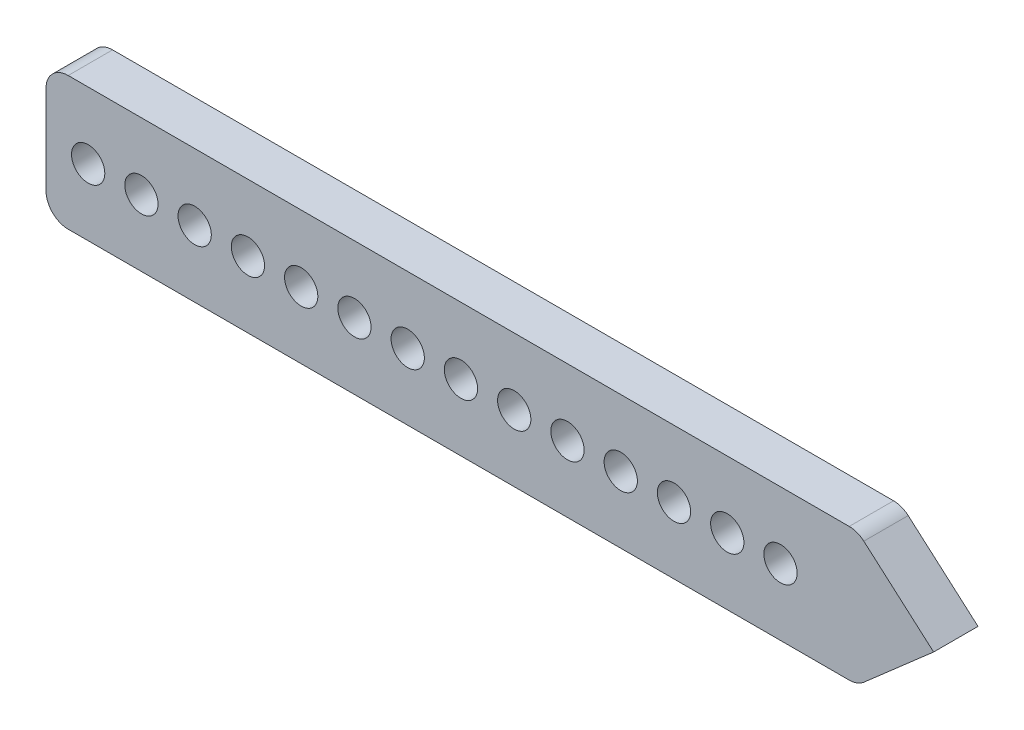
ISO-10303-21;
HEADER;
FILE_DESCRIPTION(('STEP AP214'),'2;1');
FILE_NAME('part.step','',(''),(''),'','','');
FILE_SCHEMA(('AUTOMOTIVE_DESIGN { 1 0 10303 214 1 1 1 1 }'));
ENDSEC;
DATA;
#1=APPLICATION_CONTEXT('core data for automotive mechanical design processes');
#2=APPLICATION_PROTOCOL_DEFINITION('international standard','automotive_design',2000,#1);
#3=PRODUCT_CONTEXT('',#1,'mechanical');
#4=PRODUCT('Part','Part','',(#3));
#5=PRODUCT_RELATED_PRODUCT_CATEGORY('part','',(#4));
#6=PRODUCT_DEFINITION_FORMATION('','',#4);
#7=PRODUCT_DEFINITION_CONTEXT('part definition',#1,'design');
#8=PRODUCT_DEFINITION('design','',#6,#7);
#9=PRODUCT_DEFINITION_SHAPE('','',#8);
#10=(LENGTH_UNIT() NAMED_UNIT(*) SI_UNIT(.MILLI.,.METRE.));
#11=(NAMED_UNIT(*) PLANE_ANGLE_UNIT() SI_UNIT($,.RADIAN.));
#12=(NAMED_UNIT(*) SI_UNIT($,.STERADIAN.) SOLID_ANGLE_UNIT());
#13=UNCERTAINTY_MEASURE_WITH_UNIT(LENGTH_MEASURE(1.E-05),#10,'distance_accuracy_value','');
#14=(GEOMETRIC_REPRESENTATION_CONTEXT(3) GLOBAL_UNCERTAINTY_ASSIGNED_CONTEXT((#13)) GLOBAL_UNIT_ASSIGNED_CONTEXT((#10,
#11,#12)) REPRESENTATION_CONTEXT('',''));
#15=CARTESIAN_POINT('',(0.,0.,0.));
#16=DIRECTION('',(0.,0.,1.));
#17=DIRECTION('',(1.,0.,0.));
#18=AXIS2_PLACEMENT_3D('',#15,#16,#17);
#19=CARTESIAN_POINT('',(17.9099791588191,2.,2.));
#20=DIRECTION('',(0.,0.,-1.));
#21=DIRECTION('',(-1.,0.,0.));
#22=AXIS2_PLACEMENT_3D('',#19,#20,#21);
#23=PLANE('',#22);
#24=DIRECTION('',(-0.752576682254107,0.658504622100256,0.));
#25=VECTOR('',#24,1.);
#26=CARTESIAN_POINT('',(21.7142857142857,-1.14477163139563E-07,2.));
#27=LINE('',#26,#25);
#28=CARTESIAN_POINT('',(21.7142857142857,-1.14477163139563E-07,2.));
#29=VERTEX_POINT('',#28);
#30=CARTESIAN_POINT('',(18.5684837809194,2.75257668225411,2.));
#31=VERTEX_POINT('',#30);
#32=EDGE_CURVE('E159',#29,#31,#27,.T.);
#33=ORIENTED_EDGE('',*,*,#32,.T.);
#34=CARTESIAN_POINT('',(17.9099791588191,2.,2.));
#35=DIRECTION('',(0.,0.,1.));
#36=DIRECTION('',(-1.,0.,0.));
#37=AXIS2_PLACEMENT_3D('',#34,#35,#36);
#38=CIRCLE('',#37,1.);
#39=CARTESIAN_POINT('',(17.9099791588191,3.,2.));
#40=VERTEX_POINT('',#39);
#41=EDGE_CURVE('E102',#31,#40,#38,.T.);
#42=ORIENTED_EDGE('',*,*,#41,.T.);
#43=DIRECTION('',(-1.,0.,0.));
#44=VECTOR('',#43,1.);
#45=CARTESIAN_POINT('',(-17.2857142857143,3.,2.));
#46=LINE('',#45,#44);
#47=CARTESIAN_POINT('',(-17.2857142857143,3.,2.));
#48=VERTEX_POINT('',#47);
#49=EDGE_CURVE('E177',#40,#48,#46,.T.);
#50=ORIENTED_EDGE('',*,*,#49,.T.);
#51=CARTESIAN_POINT('',(-17.2857142857143,2.,2.));
#52=DIRECTION('',(0.,0.,1.));
#53=DIRECTION('',(1.,0.,0.));
#54=AXIS2_PLACEMENT_3D('',#51,#52,#53);
#55=CIRCLE('',#54,1.);
#56=CARTESIAN_POINT('',(-18.2857142857143,2.,2.));
#57=VERTEX_POINT('',#56);
#58=EDGE_CURVE('E194',#48,#57,#55,.T.);
#59=ORIENTED_EDGE('',*,*,#58,.T.);
#60=DIRECTION('',(0.,-1.,0.));
#61=VECTOR('',#60,1.);
#62=CARTESIAN_POINT('',(-18.2857142857143,2.,2.));
#63=LINE('',#62,#61);
#64=CARTESIAN_POINT('',(-18.2857142857143,-2.,2.));
#65=VERTEX_POINT('',#64);
#66=EDGE_CURVE('E193',#57,#65,#63,.T.);
#67=ORIENTED_EDGE('',*,*,#66,.T.);
#68=CARTESIAN_POINT('',(-17.2857142857143,-2.,2.));
#69=DIRECTION('',(0.,0.,1.));
#70=DIRECTION('',(1.,0.,0.));
#71=AXIS2_PLACEMENT_3D('',#68,#69,#70);
#72=CIRCLE('',#71,1.);
#73=CARTESIAN_POINT('',(-17.2857142857143,-3.,2.));
#74=VERTEX_POINT('',#73);
#75=EDGE_CURVE('E124',#65,#74,#72,.T.);
#76=ORIENTED_EDGE('',*,*,#75,.T.);
#77=DIRECTION('',(1.,0.,0.));
#78=VECTOR('',#77,1.);
#79=CARTESIAN_POINT('',(-17.2857142857143,-3.,2.));
#80=LINE('',#79,#78);
#81=CARTESIAN_POINT('',(17.9099791803995,-3.,2.));
#82=VERTEX_POINT('',#81);
#83=EDGE_CURVE('E118',#74,#82,#80,.T.);
#84=ORIENTED_EDGE('',*,*,#83,.T.);
#85=CARTESIAN_POINT('',(17.9099791803995,-2.,2.));
#86=DIRECTION('',(0.,0.,1.));
#87=DIRECTION('',(1.,0.,0.));
#88=AXIS2_PLACEMENT_3D('',#85,#86,#87);
#89=CIRCLE('',#88,1.);
#90=CARTESIAN_POINT('',(18.5684837740363,-2.75257670715965,2.));
#91=VERTEX_POINT('',#90);
#92=EDGE_CURVE('E122',#82,#91,#89,.T.);
#93=ORIENTED_EDGE('',*,*,#92,.T.);
#94=DIRECTION('',(0.752576707159649,0.658504593636779,0.));
#95=VECTOR('',#94,1.);
#96=CARTESIAN_POINT('',(18.5684837740363,-2.75257670715965,2.));
#97=LINE('',#96,#95);
#98=EDGE_CURVE('E56',#91,#29,#97,.T.);
#99=ORIENTED_EDGE('',*,*,#98,.T.);
#100=EDGE_LOOP('',(#33,#42,#50,#59,#67,#76,#84,#93,#99));
#101=FACE_BOUND('',#100,.T.);
#102=CARTESIAN_POINT('',(-16.3857142857143,0.,2.));
#103=DIRECTION('',(0.,0.,1.));
#104=DIRECTION('',(1.,0.,0.));
#105=AXIS2_PLACEMENT_3D('',#102,#103,#104);
#106=CIRCLE('',#105,0.749999999999998);
#107=CARTESIAN_POINT('',(-15.6357142857143,0.,2.));
#108=VERTEX_POINT('',#107);
#109=EDGE_CURVE('E146',#108,#108,#106,.T.);
#110=ORIENTED_EDGE('',*,*,#109,.F.);
#111=EDGE_LOOP('',(#110));
#112=FACE_BOUND('',#111,.T.);
#113=CARTESIAN_POINT('',(-13.9857142857143,0.,2.));
#114=DIRECTION('',(0.,0.,1.));
#115=DIRECTION('',(1.,0.,0.));
#116=AXIS2_PLACEMENT_3D('',#113,#114,#115);
#117=CIRCLE('',#116,0.75);
#118=CARTESIAN_POINT('',(-13.2357142857143,0.,2.));
#119=VERTEX_POINT('',#118);
#120=EDGE_CURVE('E204',#119,#119,#117,.T.);
#121=ORIENTED_EDGE('',*,*,#120,.F.);
#122=EDGE_LOOP('',(#121));
#123=FACE_BOUND('',#122,.T.);
#124=CARTESIAN_POINT('',(-11.5857142857143,0.,2.));
#125=DIRECTION('',(0.,0.,1.));
#126=DIRECTION('',(1.,0.,0.));
#127=AXIS2_PLACEMENT_3D('',#124,#125,#126);
#128=CIRCLE('',#127,0.749999999999998);
#129=CARTESIAN_POINT('',(-10.8357142857143,0.,2.));
#130=VERTEX_POINT('',#129);
#131=EDGE_CURVE('E210',#130,#130,#128,.T.);
#132=ORIENTED_EDGE('',*,*,#131,.F.);
#133=EDGE_LOOP('',(#132));
#134=FACE_BOUND('',#133,.T.);
#135=CARTESIAN_POINT('',(-9.1857142857143,0.,2.));
#136=DIRECTION('',(0.,0.,1.));
#137=DIRECTION('',(1.,0.,0.));
#138=AXIS2_PLACEMENT_3D('',#135,#136,#137);
#139=CIRCLE('',#138,0.749999999999998);
#140=CARTESIAN_POINT('',(-8.4357142857143,0.,2.));
#141=VERTEX_POINT('',#140);
#142=EDGE_CURVE('E216',#141,#141,#139,.T.);
#143=ORIENTED_EDGE('',*,*,#142,.F.);
#144=EDGE_LOOP('',(#143));
#145=FACE_BOUND('',#144,.T.);
#146=CARTESIAN_POINT('',(-6.7857142857143,0.,2.));
#147=DIRECTION('',(0.,0.,1.));
#148=DIRECTION('',(1.,0.,0.));
#149=AXIS2_PLACEMENT_3D('',#146,#147,#148);
#150=CIRCLE('',#149,0.749999999999998);
#151=CARTESIAN_POINT('',(-6.0357142857143,0.,2.));
#152=VERTEX_POINT('',#151);
#153=EDGE_CURVE('E222',#152,#152,#150,.T.);
#154=ORIENTED_EDGE('',*,*,#153,.F.);
#155=EDGE_LOOP('',(#154));
#156=FACE_BOUND('',#155,.T.);
#157=CARTESIAN_POINT('',(-4.3857142857143,0.,2.));
#158=DIRECTION('',(0.,0.,1.));
#159=DIRECTION('',(1.,0.,0.));
#160=AXIS2_PLACEMENT_3D('',#157,#158,#159);
#161=CIRCLE('',#160,0.749999999999998);
#162=CARTESIAN_POINT('',(-3.6357142857143,0.,2.));
#163=VERTEX_POINT('',#162);
#164=EDGE_CURVE('E228',#163,#163,#161,.T.);
#165=ORIENTED_EDGE('',*,*,#164,.F.);
#166=EDGE_LOOP('',(#165));
#167=FACE_BOUND('',#166,.T.);
#168=CARTESIAN_POINT('',(-1.9857142857143,0.,2.));
#169=DIRECTION('',(0.,0.,1.));
#170=DIRECTION('',(1.,0.,0.));
#171=AXIS2_PLACEMENT_3D('',#168,#169,#170);
#172=CIRCLE('',#171,0.749999999999998);
#173=CARTESIAN_POINT('',(-1.2357142857143,0.,2.));
#174=VERTEX_POINT('',#173);
#175=EDGE_CURVE('E234',#174,#174,#172,.T.);
#176=ORIENTED_EDGE('',*,*,#175,.F.);
#177=EDGE_LOOP('',(#176));
#178=FACE_BOUND('',#177,.T.);
#179=CARTESIAN_POINT('',(0.414285714285702,0.,2.));
#180=DIRECTION('',(0.,0.,1.));
#181=DIRECTION('',(1.,0.,0.));
#182=AXIS2_PLACEMENT_3D('',#179,#180,#181);
#183=CIRCLE('',#182,0.749999999999998);
#184=CARTESIAN_POINT('',(1.1642857142857,0.,2.));
#185=VERTEX_POINT('',#184);
#186=EDGE_CURVE('E240',#185,#185,#183,.T.);
#187=ORIENTED_EDGE('',*,*,#186,.F.);
#188=EDGE_LOOP('',(#187));
#189=FACE_BOUND('',#188,.T.);
#190=CARTESIAN_POINT('',(2.8142857142857,0.,2.));
#191=DIRECTION('',(0.,0.,1.));
#192=DIRECTION('',(1.,0.,0.));
#193=AXIS2_PLACEMENT_3D('',#190,#191,#192);
#194=CIRCLE('',#193,0.749999999999998);
#195=CARTESIAN_POINT('',(3.5642857142857,0.,2.));
#196=VERTEX_POINT('',#195);
#197=EDGE_CURVE('E246',#196,#196,#194,.T.);
#198=ORIENTED_EDGE('',*,*,#197,.F.);
#199=EDGE_LOOP('',(#198));
#200=FACE_BOUND('',#199,.T.);
#201=CARTESIAN_POINT('',(5.2142857142857,0.,2.));
#202=DIRECTION('',(0.,0.,1.));
#203=DIRECTION('',(1.,0.,0.));
#204=AXIS2_PLACEMENT_3D('',#201,#202,#203);
#205=CIRCLE('',#204,0.749999999999998);
#206=CARTESIAN_POINT('',(5.9642857142857,0.,2.));
#207=VERTEX_POINT('',#206);
#208=EDGE_CURVE('E252',#207,#207,#205,.T.);
#209=ORIENTED_EDGE('',*,*,#208,.F.);
#210=EDGE_LOOP('',(#209));
#211=FACE_BOUND('',#210,.T.);
#212=CARTESIAN_POINT('',(7.6142857142857,0.,2.));
#213=DIRECTION('',(0.,0.,1.));
#214=DIRECTION('',(1.,0.,0.));
#215=AXIS2_PLACEMENT_3D('',#212,#213,#214);
#216=CIRCLE('',#215,0.749999999999998);
#217=CARTESIAN_POINT('',(8.3642857142857,0.,2.));
#218=VERTEX_POINT('',#217);
#219=EDGE_CURVE('E258',#218,#218,#216,.T.);
#220=ORIENTED_EDGE('',*,*,#219,.F.);
#221=EDGE_LOOP('',(#220));
#222=FACE_BOUND('',#221,.T.);
#223=CARTESIAN_POINT('',(10.0142857142857,0.,2.));
#224=DIRECTION('',(0.,0.,1.));
#225=DIRECTION('',(1.,0.,0.));
#226=AXIS2_PLACEMENT_3D('',#223,#224,#225);
#227=CIRCLE('',#226,0.749999999999998);
#228=CARTESIAN_POINT('',(10.7642857142857,0.,2.));
#229=VERTEX_POINT('',#228);
#230=EDGE_CURVE('E264',#229,#229,#227,.T.);
#231=ORIENTED_EDGE('',*,*,#230,.F.);
#232=EDGE_LOOP('',(#231));
#233=FACE_BOUND('',#232,.T.);
#234=CARTESIAN_POINT('',(12.4142857142857,0.,2.));
#235=DIRECTION('',(0.,0.,1.));
#236=DIRECTION('',(1.,0.,0.));
#237=AXIS2_PLACEMENT_3D('',#234,#235,#236);
#238=CIRCLE('',#237,0.749999999999998);
#239=CARTESIAN_POINT('',(13.1642857142857,0.,2.));
#240=VERTEX_POINT('',#239);
#241=EDGE_CURVE('E270',#240,#240,#238,.T.);
#242=ORIENTED_EDGE('',*,*,#241,.F.);
#243=EDGE_LOOP('',(#242));
#244=FACE_BOUND('',#243,.T.);
#245=CARTESIAN_POINT('',(14.8142857142857,0.,2.));
#246=DIRECTION('',(0.,0.,1.));
#247=DIRECTION('',(1.,0.,0.));
#248=AXIS2_PLACEMENT_3D('',#245,#246,#247);
#249=CIRCLE('',#248,0.749999999999998);
#250=CARTESIAN_POINT('',(15.5642857142857,0.,2.));
#251=VERTEX_POINT('',#250);
#252=EDGE_CURVE('E276',#251,#251,#249,.T.);
#253=ORIENTED_EDGE('',*,*,#252,.F.);
#254=EDGE_LOOP('',(#253));
#255=FACE_BOUND('',#254,.T.);
#256=ADVANCED_FACE('F39',(#101,#112,#123,#134,#145,#156,#167,#178,#189,#200,#211,#222,#233,#244,
#255),#23,.F.);
#257=CARTESIAN_POINT('',(17.9099791588191,2.,0.));
#258=DIRECTION('',(0.,0.,-1.));
#259=DIRECTION('',(-1.,0.,0.));
#260=AXIS2_PLACEMENT_3D('',#257,#258,#259);
#261=PLANE('',#260);
#262=CARTESIAN_POINT('',(12.4142857142857,0.,0.));
#263=DIRECTION('',(0.,0.,1.));
#264=DIRECTION('',(1.,0.,0.));
#265=AXIS2_PLACEMENT_3D('',#262,#263,#264);
#266=CIRCLE('',#265,0.749999999999998);
#267=CARTESIAN_POINT('',(13.1642857142857,0.,0.));
#268=VERTEX_POINT('',#267);
#269=EDGE_CURVE('E273',#268,#268,#266,.T.);
#270=ORIENTED_EDGE('',*,*,#269,.T.);
#271=EDGE_LOOP('',(#270));
#272=FACE_BOUND('',#271,.T.);
#273=CARTESIAN_POINT('',(7.6142857142857,0.,0.));
#274=DIRECTION('',(0.,0.,1.));
#275=DIRECTION('',(1.,0.,0.));
#276=AXIS2_PLACEMENT_3D('',#273,#274,#275);
#277=CIRCLE('',#276,0.749999999999998);
#278=CARTESIAN_POINT('',(8.3642857142857,0.,0.));
#279=VERTEX_POINT('',#278);
#280=EDGE_CURVE('E261',#279,#279,#277,.T.);
#281=ORIENTED_EDGE('',*,*,#280,.T.);
#282=EDGE_LOOP('',(#281));
#283=FACE_BOUND('',#282,.T.);
#284=CARTESIAN_POINT('',(2.8142857142857,0.,0.));
#285=DIRECTION('',(0.,0.,1.));
#286=DIRECTION('',(1.,0.,0.));
#287=AXIS2_PLACEMENT_3D('',#284,#285,#286);
#288=CIRCLE('',#287,0.749999999999998);
#289=CARTESIAN_POINT('',(3.5642857142857,0.,0.));
#290=VERTEX_POINT('',#289);
#291=EDGE_CURVE('E249',#290,#290,#288,.T.);
#292=ORIENTED_EDGE('',*,*,#291,.T.);
#293=EDGE_LOOP('',(#292));
#294=FACE_BOUND('',#293,.T.);
#295=CARTESIAN_POINT('',(-1.9857142857143,0.,0.));
#296=DIRECTION('',(0.,0.,1.));
#297=DIRECTION('',(1.,0.,0.));
#298=AXIS2_PLACEMENT_3D('',#295,#296,#297);
#299=CIRCLE('',#298,0.749999999999998);
#300=CARTESIAN_POINT('',(-1.2357142857143,0.,0.));
#301=VERTEX_POINT('',#300);
#302=EDGE_CURVE('E237',#301,#301,#299,.T.);
#303=ORIENTED_EDGE('',*,*,#302,.T.);
#304=EDGE_LOOP('',(#303));
#305=FACE_BOUND('',#304,.T.);
#306=CARTESIAN_POINT('',(-6.7857142857143,0.,0.));
#307=DIRECTION('',(0.,0.,1.));
#308=DIRECTION('',(1.,0.,0.));
#309=AXIS2_PLACEMENT_3D('',#306,#307,#308);
#310=CIRCLE('',#309,0.749999999999998);
#311=CARTESIAN_POINT('',(-6.0357142857143,0.,0.));
#312=VERTEX_POINT('',#311);
#313=EDGE_CURVE('E225',#312,#312,#310,.T.);
#314=ORIENTED_EDGE('',*,*,#313,.T.);
#315=EDGE_LOOP('',(#314));
#316=FACE_BOUND('',#315,.T.);
#317=CARTESIAN_POINT('',(-11.5857142857143,0.,0.));
#318=DIRECTION('',(0.,0.,1.));
#319=DIRECTION('',(1.,0.,0.));
#320=AXIS2_PLACEMENT_3D('',#317,#318,#319);
#321=CIRCLE('',#320,0.749999999999998);
#322=CARTESIAN_POINT('',(-10.8357142857143,0.,0.));
#323=VERTEX_POINT('',#322);
#324=EDGE_CURVE('E213',#323,#323,#321,.T.);
#325=ORIENTED_EDGE('',*,*,#324,.T.);
#326=EDGE_LOOP('',(#325));
#327=FACE_BOUND('',#326,.T.);
#328=CARTESIAN_POINT('',(-16.3857142857143,0.,0.));
#329=DIRECTION('',(0.,0.,1.));
#330=DIRECTION('',(1.,0.,0.));
#331=AXIS2_PLACEMENT_3D('',#328,#329,#330);
#332=CIRCLE('',#331,0.749999999999998);
#333=CARTESIAN_POINT('',(-15.6357142857143,0.,0.));
#334=VERTEX_POINT('',#333);
#335=EDGE_CURVE('E201',#334,#334,#332,.T.);
#336=ORIENTED_EDGE('',*,*,#335,.T.);
#337=EDGE_LOOP('',(#336));
#338=FACE_BOUND('',#337,.T.);
#339=DIRECTION('',(-0.752576682254107,0.658504622100256,0.));
#340=VECTOR('',#339,1.);
#341=CARTESIAN_POINT('',(21.7142857142857,-1.14477163139563E-07,0.));
#342=LINE('',#341,#340);
#343=CARTESIAN_POINT('',(21.7142857142857,-1.14477163139563E-07,0.));
#344=VERTEX_POINT('',#343);
#345=CARTESIAN_POINT('',(18.5684837809194,2.75257668225411,0.));
#346=VERTEX_POINT('',#345);
#347=EDGE_CURVE('E142',#344,#346,#342,.T.);
#348=ORIENTED_EDGE('',*,*,#347,.F.);
#349=DIRECTION('',(0.752576707159649,0.658504593636779,0.));
#350=VECTOR('',#349,1.);
#351=CARTESIAN_POINT('',(18.5684837740363,-2.75257670715965,0.));
#352=LINE('',#351,#350);
#353=CARTESIAN_POINT('',(18.5684837740363,-2.75257670715965,0.));
#354=VERTEX_POINT('',#353);
#355=EDGE_CURVE('E94',#354,#344,#352,.T.);
#356=ORIENTED_EDGE('',*,*,#355,.F.);
#357=CARTESIAN_POINT('',(17.9099791803995,-2.,0.));
#358=DIRECTION('',(0.,0.,1.));
#359=DIRECTION('',(1.,0.,0.));
#360=AXIS2_PLACEMENT_3D('',#357,#358,#359);
#361=CIRCLE('',#360,1.);
#362=CARTESIAN_POINT('',(17.9099791803995,-3.,0.));
#363=VERTEX_POINT('',#362);
#364=EDGE_CURVE('E88',#363,#354,#361,.T.);
#365=ORIENTED_EDGE('',*,*,#364,.F.);
#366=DIRECTION('',(1.,0.,0.));
#367=VECTOR('',#366,1.);
#368=CARTESIAN_POINT('',(-17.2857142857143,-3.,0.));
#369=LINE('',#368,#367);
#370=CARTESIAN_POINT('',(-17.2857142857143,-3.,0.));
#371=VERTEX_POINT('',#370);
#372=EDGE_CURVE('E132',#371,#363,#369,.T.);
#373=ORIENTED_EDGE('',*,*,#372,.F.);
#374=CARTESIAN_POINT('',(-17.2857142857143,-2.,0.));
#375=DIRECTION('',(0.,0.,1.));
#376=DIRECTION('',(1.,0.,0.));
#377=AXIS2_PLACEMENT_3D('',#374,#375,#376);
#378=CIRCLE('',#377,1.);
#379=CARTESIAN_POINT('',(-18.2857142857143,-2.,0.));
#380=VERTEX_POINT('',#379);
#381=EDGE_CURVE('E154',#380,#371,#378,.T.);
#382=ORIENTED_EDGE('',*,*,#381,.F.);
#383=DIRECTION('',(0.,-1.,0.));
#384=VECTOR('',#383,1.);
#385=CARTESIAN_POINT('',(-18.2857142857143,2.,0.));
#386=LINE('',#385,#384);
#387=CARTESIAN_POINT('',(-18.2857142857143,2.,0.));
#388=VERTEX_POINT('',#387);
#389=EDGE_CURVE('E152',#388,#380,#386,.T.);
#390=ORIENTED_EDGE('',*,*,#389,.F.);
#391=CARTESIAN_POINT('',(-17.2857142857143,2.,0.));
#392=DIRECTION('',(0.,0.,1.));
#393=DIRECTION('',(1.,0.,0.));
#394=AXIS2_PLACEMENT_3D('',#391,#392,#393);
#395=CIRCLE('',#394,1.);
#396=CARTESIAN_POINT('',(-17.2857142857143,3.,0.));
#397=VERTEX_POINT('',#396);
#398=EDGE_CURVE('E150',#397,#388,#395,.T.);
#399=ORIENTED_EDGE('',*,*,#398,.F.);
#400=DIRECTION('',(-1.,0.,0.));
#401=VECTOR('',#400,1.);
#402=CARTESIAN_POINT('',(-17.2857142857143,3.,0.));
#403=LINE('',#402,#401);
#404=CARTESIAN_POINT('',(17.9099791588191,3.,0.));
#405=VERTEX_POINT('',#404);
#406=EDGE_CURVE('E148',#405,#397,#403,.T.);
#407=ORIENTED_EDGE('',*,*,#406,.F.);
#408=CARTESIAN_POINT('',(17.9099791588191,2.,0.));
#409=DIRECTION('',(0.,0.,1.));
#410=DIRECTION('',(-1.,0.,0.));
#411=AXIS2_PLACEMENT_3D('',#408,#409,#410);
#412=CIRCLE('',#411,1.);
#413=EDGE_CURVE('E145',#346,#405,#412,.T.);
#414=ORIENTED_EDGE('',*,*,#413,.F.);
#415=EDGE_LOOP('',(#348,#356,#365,#373,#382,#390,#399,#407,#414));
#416=FACE_BOUND('',#415,.T.);
#417=CARTESIAN_POINT('',(-13.9857142857143,0.,0.));
#418=DIRECTION('',(0.,0.,1.));
#419=DIRECTION('',(1.,0.,0.));
#420=AXIS2_PLACEMENT_3D('',#417,#418,#419);
#421=CIRCLE('',#420,0.75);
#422=CARTESIAN_POINT('',(-13.2357142857143,0.,0.));
#423=VERTEX_POINT('',#422);
#424=EDGE_CURVE('E207',#423,#423,#421,.T.);
#425=ORIENTED_EDGE('',*,*,#424,.T.);
#426=EDGE_LOOP('',(#425));
#427=FACE_BOUND('',#426,.T.);
#428=CARTESIAN_POINT('',(-9.1857142857143,0.,0.));
#429=DIRECTION('',(0.,0.,1.));
#430=DIRECTION('',(1.,0.,0.));
#431=AXIS2_PLACEMENT_3D('',#428,#429,#430);
#432=CIRCLE('',#431,0.749999999999998);
#433=CARTESIAN_POINT('',(-8.4357142857143,0.,0.));
#434=VERTEX_POINT('',#433);
#435=EDGE_CURVE('E219',#434,#434,#432,.T.);
#436=ORIENTED_EDGE('',*,*,#435,.T.);
#437=EDGE_LOOP('',(#436));
#438=FACE_BOUND('',#437,.T.);
#439=CARTESIAN_POINT('',(-4.3857142857143,0.,0.));
#440=DIRECTION('',(0.,0.,1.));
#441=DIRECTION('',(1.,0.,0.));
#442=AXIS2_PLACEMENT_3D('',#439,#440,#441);
#443=CIRCLE('',#442,0.749999999999998);
#444=CARTESIAN_POINT('',(-3.6357142857143,0.,0.));
#445=VERTEX_POINT('',#444);
#446=EDGE_CURVE('E231',#445,#445,#443,.T.);
#447=ORIENTED_EDGE('',*,*,#446,.T.);
#448=EDGE_LOOP('',(#447));
#449=FACE_BOUND('',#448,.T.);
#450=CARTESIAN_POINT('',(0.414285714285702,0.,0.));
#451=DIRECTION('',(0.,0.,1.));
#452=DIRECTION('',(1.,0.,0.));
#453=AXIS2_PLACEMENT_3D('',#450,#451,#452);
#454=CIRCLE('',#453,0.749999999999998);
#455=CARTESIAN_POINT('',(1.1642857142857,0.,0.));
#456=VERTEX_POINT('',#455);
#457=EDGE_CURVE('E243',#456,#456,#454,.T.);
#458=ORIENTED_EDGE('',*,*,#457,.T.);
#459=EDGE_LOOP('',(#458));
#460=FACE_BOUND('',#459,.T.);
#461=CARTESIAN_POINT('',(5.2142857142857,0.,0.));
#462=DIRECTION('',(0.,0.,1.));
#463=DIRECTION('',(1.,0.,0.));
#464=AXIS2_PLACEMENT_3D('',#461,#462,#463);
#465=CIRCLE('',#464,0.749999999999998);
#466=CARTESIAN_POINT('',(5.9642857142857,0.,0.));
#467=VERTEX_POINT('',#466);
#468=EDGE_CURVE('E255',#467,#467,#465,.T.);
#469=ORIENTED_EDGE('',*,*,#468,.T.);
#470=EDGE_LOOP('',(#469));
#471=FACE_BOUND('',#470,.T.);
#472=CARTESIAN_POINT('',(10.0142857142857,0.,0.));
#473=DIRECTION('',(0.,0.,1.));
#474=DIRECTION('',(1.,0.,0.));
#475=AXIS2_PLACEMENT_3D('',#472,#473,#474);
#476=CIRCLE('',#475,0.749999999999998);
#477=CARTESIAN_POINT('',(10.7642857142857,0.,0.));
#478=VERTEX_POINT('',#477);
#479=EDGE_CURVE('E267',#478,#478,#476,.T.);
#480=ORIENTED_EDGE('',*,*,#479,.T.);
#481=EDGE_LOOP('',(#480));
#482=FACE_BOUND('',#481,.T.);
#483=CARTESIAN_POINT('',(14.8142857142857,0.,0.));
#484=DIRECTION('',(0.,0.,1.));
#485=DIRECTION('',(1.,0.,0.));
#486=AXIS2_PLACEMENT_3D('',#483,#484,#485);
#487=CIRCLE('',#486,0.749999999999998);
#488=CARTESIAN_POINT('',(15.5642857142857,0.,0.));
#489=VERTEX_POINT('',#488);
#490=EDGE_CURVE('E279',#489,#489,#487,.T.);
#491=ORIENTED_EDGE('',*,*,#490,.T.);
#492=EDGE_LOOP('',(#491));
#493=FACE_BOUND('',#492,.T.);
#494=ADVANCED_FACE('F181',(#272,#283,#294,#305,#316,#327,#338,#416,#427,#438,#449,#460,#471,
#482,#493),#261,.T.);
#495=CARTESIAN_POINT('',(21.7142857142857,-1.14477163139563E-07,2.));
#496=DIRECTION('',(-0.658504622100256,-0.752576682254107,0.));
#497=DIRECTION('',(0.752576682254107,-0.658504622100256,0.));
#498=AXIS2_PLACEMENT_3D('',#495,#496,#497);
#499=PLANE('',#498);
#500=ORIENTED_EDGE('',*,*,#347,.T.);
#501=DIRECTION('',(0.,0.,-1.));
#502=VECTOR('',#501,1.);
#503=CARTESIAN_POINT('',(18.5684837809194,2.75257668225411,2.));
#504=LINE('',#503,#502);
#505=EDGE_CURVE('E11',#31,#346,#504,.T.);
#506=ORIENTED_EDGE('',*,*,#505,.F.);
#507=ORIENTED_EDGE('',*,*,#32,.F.);
#508=DIRECTION('',(0.,0.,-1.));
#509=VECTOR('',#508,1.);
#510=CARTESIAN_POINT('',(21.7142857142857,-1.14477163139563E-07,2.));
#511=LINE('',#510,#509);
#512=EDGE_CURVE('E138',#29,#344,#511,.T.);
#513=ORIENTED_EDGE('',*,*,#512,.T.);
#514=EDGE_LOOP('',(#500,#506,#507,#513));
#515=FACE_BOUND('',#514,.T.);
#516=ADVANCED_FACE('F41',(#515),#499,.F.);
#517=CARTESIAN_POINT('',(17.9099791588191,2.,2.));
#518=DIRECTION('',(0.,0.,-1.));
#519=DIRECTION('',(-1.,0.,0.));
#520=AXIS2_PLACEMENT_3D('',#517,#518,#519);
#521=CYLINDRICAL_SURFACE('',#520,1.);
#522=ORIENTED_EDGE('',*,*,#413,.T.);
#523=DIRECTION('',(0.,0.,-1.));
#524=VECTOR('',#523,1.);
#525=CARTESIAN_POINT('',(17.9099791588191,3.,2.));
#526=LINE('',#525,#524);
#527=EDGE_CURVE('E48',#40,#405,#526,.T.);
#528=ORIENTED_EDGE('',*,*,#527,.F.);
#529=ORIENTED_EDGE('',*,*,#41,.F.);
#530=ORIENTED_EDGE('',*,*,#505,.T.);
#531=EDGE_LOOP('',(#522,#528,#529,#530));
#532=FACE_BOUND('',#531,.T.);
#533=ADVANCED_FACE('F315',(#532),#521,.T.);
#534=CARTESIAN_POINT('',(-17.2857142857143,3.,2.));
#535=DIRECTION('',(0.,-1.,0.));
#536=DIRECTION('',(0.,0.,-1.));
#537=AXIS2_PLACEMENT_3D('',#534,#535,#536);
#538=PLANE('',#537);
#539=ORIENTED_EDGE('',*,*,#406,.T.);
#540=DIRECTION('',(0.,0.,-1.));
#541=VECTOR('',#540,1.);
#542=CARTESIAN_POINT('',(-17.2857142857143,3.,2.));
#543=LINE('',#542,#541);
#544=EDGE_CURVE('E169',#48,#397,#543,.T.);
#545=ORIENTED_EDGE('',*,*,#544,.F.);
#546=ORIENTED_EDGE('',*,*,#49,.F.);
#547=ORIENTED_EDGE('',*,*,#527,.T.);
#548=EDGE_LOOP('',(#539,#545,#546,#547));
#549=FACE_BOUND('',#548,.T.);
#550=ADVANCED_FACE('F175',(#549),#538,.F.);
#551=CARTESIAN_POINT('',(-17.2857142857143,2.,2.));
#552=DIRECTION('',(0.,0.,-1.));
#553=DIRECTION('',(-1.,0.,0.));
#554=AXIS2_PLACEMENT_3D('',#551,#552,#553);
#555=CYLINDRICAL_SURFACE('',#554,1.);
#556=ORIENTED_EDGE('',*,*,#398,.T.);
#557=DIRECTION('',(0.,0.,-1.));
#558=VECTOR('',#557,1.);
#559=CARTESIAN_POINT('',(-18.2857142857143,2.,2.));
#560=LINE('',#559,#558);
#561=EDGE_CURVE('E166',#57,#388,#560,.T.);
#562=ORIENTED_EDGE('',*,*,#561,.F.);
#563=ORIENTED_EDGE('',*,*,#58,.F.);
#564=ORIENTED_EDGE('',*,*,#544,.T.);
#565=EDGE_LOOP('',(#556,#562,#563,#564));
#566=FACE_BOUND('',#565,.T.);
#567=ADVANCED_FACE('F187',(#566),#555,.T.);
#568=CARTESIAN_POINT('',(-18.2857142857143,2.,2.));
#569=DIRECTION('',(1.,0.,0.));
#570=DIRECTION('',(0.,0.,-1.));
#571=AXIS2_PLACEMENT_3D('',#568,#569,#570);
#572=PLANE('',#571);
#573=ORIENTED_EDGE('',*,*,#389,.T.);
#574=DIRECTION('',(0.,0.,-1.));
#575=VECTOR('',#574,1.);
#576=CARTESIAN_POINT('',(-18.2857142857143,-2.,2.));
#577=LINE('',#576,#575);
#578=EDGE_CURVE('E163',#65,#380,#577,.T.);
#579=ORIENTED_EDGE('',*,*,#578,.F.);
#580=ORIENTED_EDGE('',*,*,#66,.F.);
#581=ORIENTED_EDGE('',*,*,#561,.T.);
#582=EDGE_LOOP('',(#573,#579,#580,#581));
#583=FACE_BOUND('',#582,.T.);
#584=ADVANCED_FACE('F191',(#583),#572,.F.);
#585=CARTESIAN_POINT('',(-17.2857142857143,-2.,2.));
#586=DIRECTION('',(0.,0.,-1.));
#587=DIRECTION('',(-1.,0.,0.));
#588=AXIS2_PLACEMENT_3D('',#585,#586,#587);
#589=CYLINDRICAL_SURFACE('',#588,1.);
#590=ORIENTED_EDGE('',*,*,#381,.T.);
#591=DIRECTION('',(0.,0.,-1.));
#592=VECTOR('',#591,1.);
#593=CARTESIAN_POINT('',(-17.2857142857143,-3.,2.));
#594=LINE('',#593,#592);
#595=EDGE_CURVE('E133',#74,#371,#594,.T.);
#596=ORIENTED_EDGE('',*,*,#595,.F.);
#597=ORIENTED_EDGE('',*,*,#75,.F.);
#598=ORIENTED_EDGE('',*,*,#578,.T.);
#599=EDGE_LOOP('',(#590,#596,#597,#598));
#600=FACE_BOUND('',#599,.T.);
#601=ADVANCED_FACE('F306',(#600),#589,.T.);
#602=CARTESIAN_POINT('',(-17.2857142857143,-3.,2.));
#603=DIRECTION('',(0.,1.,0.));
#604=DIRECTION('',(0.,0.,1.));
#605=AXIS2_PLACEMENT_3D('',#602,#603,#604);
#606=PLANE('',#605);
#607=ORIENTED_EDGE('',*,*,#372,.T.);
#608=DIRECTION('',(0.,0.,-1.));
#609=VECTOR('',#608,1.);
#610=CARTESIAN_POINT('',(17.9099791803995,-3.,2.));
#611=LINE('',#610,#609);
#612=EDGE_CURVE('E129',#82,#363,#611,.T.);
#613=ORIENTED_EDGE('',*,*,#612,.F.);
#614=ORIENTED_EDGE('',*,*,#83,.F.);
#615=ORIENTED_EDGE('',*,*,#595,.T.);
#616=EDGE_LOOP('',(#607,#613,#614,#615));
#617=FACE_BOUND('',#616,.T.);
#618=ADVANCED_FACE('F130',(#617),#606,.F.);
#619=CARTESIAN_POINT('',(17.9099791803995,-2.,2.));
#620=DIRECTION('',(0.,0.,-1.));
#621=DIRECTION('',(-1.,0.,0.));
#622=AXIS2_PLACEMENT_3D('',#619,#620,#621);
#623=CYLINDRICAL_SURFACE('',#622,1.);
#624=ORIENTED_EDGE('',*,*,#364,.T.);
#625=DIRECTION('',(0.,0.,-1.));
#626=VECTOR('',#625,1.);
#627=CARTESIAN_POINT('',(18.5684837740363,-2.75257670715965,2.));
#628=LINE('',#627,#626);
#629=EDGE_CURVE('E134',#91,#354,#628,.T.);
#630=ORIENTED_EDGE('',*,*,#629,.F.);
#631=ORIENTED_EDGE('',*,*,#92,.F.);
#632=ORIENTED_EDGE('',*,*,#612,.T.);
#633=EDGE_LOOP('',(#624,#630,#631,#632));
#634=FACE_BOUND('',#633,.T.);
#635=ADVANCED_FACE('F136',(#634),#623,.T.);
#636=CARTESIAN_POINT('',(18.5684837740363,-2.75257670715965,2.));
#637=DIRECTION('',(-0.658504593636779,0.752576707159649,0.));
#638=DIRECTION('',(-0.752576707159649,-0.658504593636779,0.));
#639=AXIS2_PLACEMENT_3D('',#636,#637,#638);
#640=PLANE('',#639);
#641=ORIENTED_EDGE('',*,*,#355,.T.);
#642=ORIENTED_EDGE('',*,*,#512,.F.);
#643=ORIENTED_EDGE('',*,*,#98,.F.);
#644=ORIENTED_EDGE('',*,*,#629,.T.);
#645=EDGE_LOOP('',(#641,#642,#643,#644));
#646=FACE_BOUND('',#645,.T.);
#647=ADVANCED_FACE('F299',(#646),#640,.F.);
#648=CARTESIAN_POINT('',(-16.3857142857143,0.,2.));
#649=DIRECTION('',(0.,0.,-1.));
#650=DIRECTION('',(-1.,0.,0.));
#651=AXIS2_PLACEMENT_3D('',#648,#649,#650);
#652=CYLINDRICAL_SURFACE('',#651,0.749999999999998);
#653=ORIENTED_EDGE('',*,*,#109,.T.);
#654=EDGE_LOOP('',(#653));
#655=FACE_BOUND('',#654,.T.);
#656=ORIENTED_EDGE('',*,*,#335,.F.);
#657=EDGE_LOOP('',(#656));
#658=FACE_BOUND('',#657,.T.);
#659=ADVANCED_FACE('F296',(#655,#658),#652,.F.);
#660=CARTESIAN_POINT('',(-13.9857142857143,0.,2.));
#661=DIRECTION('',(0.,0.,-1.));
#662=DIRECTION('',(-1.,0.,0.));
#663=AXIS2_PLACEMENT_3D('',#660,#661,#662);
#664=CYLINDRICAL_SURFACE('',#663,0.75);
#665=ORIENTED_EDGE('',*,*,#120,.T.);
#666=EDGE_LOOP('',(#665));
#667=FACE_BOUND('',#666,.T.);
#668=ORIENTED_EDGE('',*,*,#424,.F.);
#669=EDGE_LOOP('',(#668));
#670=FACE_BOUND('',#669,.T.);
#671=ADVANCED_FACE('F383',(#667,#670),#664,.F.);
#672=CARTESIAN_POINT('',(-11.5857142857143,0.,2.));
#673=DIRECTION('',(0.,0.,-1.));
#674=DIRECTION('',(-1.,0.,0.));
#675=AXIS2_PLACEMENT_3D('',#672,#673,#674);
#676=CYLINDRICAL_SURFACE('',#675,0.749999999999998);
#677=ORIENTED_EDGE('',*,*,#131,.T.);
#678=EDGE_LOOP('',(#677));
#679=FACE_BOUND('',#678,.T.);
#680=ORIENTED_EDGE('',*,*,#324,.F.);
#681=EDGE_LOOP('',(#680));
#682=FACE_BOUND('',#681,.T.);
#683=ADVANCED_FACE('F391',(#679,#682),#676,.F.);
#684=CARTESIAN_POINT('',(-9.1857142857143,0.,2.));
#685=DIRECTION('',(0.,0.,-1.));
#686=DIRECTION('',(-1.,0.,0.));
#687=AXIS2_PLACEMENT_3D('',#684,#685,#686);
#688=CYLINDRICAL_SURFACE('',#687,0.749999999999998);
#689=ORIENTED_EDGE('',*,*,#142,.T.);
#690=EDGE_LOOP('',(#689));
#691=FACE_BOUND('',#690,.T.);
#692=ORIENTED_EDGE('',*,*,#435,.F.);
#693=EDGE_LOOP('',(#692));
#694=FACE_BOUND('',#693,.T.);
#695=ADVANCED_FACE('F399',(#691,#694),#688,.F.);
#696=CARTESIAN_POINT('',(-6.7857142857143,0.,2.));
#697=DIRECTION('',(0.,0.,-1.));
#698=DIRECTION('',(-1.,0.,0.));
#699=AXIS2_PLACEMENT_3D('',#696,#697,#698);
#700=CYLINDRICAL_SURFACE('',#699,0.749999999999998);
#701=ORIENTED_EDGE('',*,*,#153,.T.);
#702=EDGE_LOOP('',(#701));
#703=FACE_BOUND('',#702,.T.);
#704=ORIENTED_EDGE('',*,*,#313,.F.);
#705=EDGE_LOOP('',(#704));
#706=FACE_BOUND('',#705,.T.);
#707=ADVANCED_FACE('F408',(#703,#706),#700,.F.);
#708=CARTESIAN_POINT('',(-4.3857142857143,0.,2.));
#709=DIRECTION('',(0.,0.,-1.));
#710=DIRECTION('',(-1.,0.,0.));
#711=AXIS2_PLACEMENT_3D('',#708,#709,#710);
#712=CYLINDRICAL_SURFACE('',#711,0.749999999999998);
#713=ORIENTED_EDGE('',*,*,#164,.T.);
#714=EDGE_LOOP('',(#713));
#715=FACE_BOUND('',#714,.T.);
#716=ORIENTED_EDGE('',*,*,#446,.F.);
#717=EDGE_LOOP('',(#716));
#718=FACE_BOUND('',#717,.T.);
#719=ADVANCED_FACE('F417',(#715,#718),#712,.F.);
#720=CARTESIAN_POINT('',(-1.9857142857143,0.,2.));
#721=DIRECTION('',(0.,0.,-1.));
#722=DIRECTION('',(-1.,0.,0.));
#723=AXIS2_PLACEMENT_3D('',#720,#721,#722);
#724=CYLINDRICAL_SURFACE('',#723,0.749999999999998);
#725=ORIENTED_EDGE('',*,*,#175,.T.);
#726=EDGE_LOOP('',(#725));
#727=FACE_BOUND('',#726,.T.);
#728=ORIENTED_EDGE('',*,*,#302,.F.);
#729=EDGE_LOOP('',(#728));
#730=FACE_BOUND('',#729,.T.);
#731=ADVANCED_FACE('F426',(#727,#730),#724,.F.);
#732=CARTESIAN_POINT('',(0.414285714285702,0.,2.));
#733=DIRECTION('',(0.,0.,-1.));
#734=DIRECTION('',(-1.,0.,0.));
#735=AXIS2_PLACEMENT_3D('',#732,#733,#734);
#736=CYLINDRICAL_SURFACE('',#735,0.749999999999998);
#737=ORIENTED_EDGE('',*,*,#186,.T.);
#738=EDGE_LOOP('',(#737));
#739=FACE_BOUND('',#738,.T.);
#740=ORIENTED_EDGE('',*,*,#457,.F.);
#741=EDGE_LOOP('',(#740));
#742=FACE_BOUND('',#741,.T.);
#743=ADVANCED_FACE('F435',(#739,#742),#736,.F.);
#744=CARTESIAN_POINT('',(2.8142857142857,0.,2.));
#745=DIRECTION('',(0.,0.,-1.));
#746=DIRECTION('',(-1.,0.,0.));
#747=AXIS2_PLACEMENT_3D('',#744,#745,#746);
#748=CYLINDRICAL_SURFACE('',#747,0.749999999999998);
#749=ORIENTED_EDGE('',*,*,#197,.T.);
#750=EDGE_LOOP('',(#749));
#751=FACE_BOUND('',#750,.T.);
#752=ORIENTED_EDGE('',*,*,#291,.F.);
#753=EDGE_LOOP('',(#752));
#754=FACE_BOUND('',#753,.T.);
#755=ADVANCED_FACE('F444',(#751,#754),#748,.F.);
#756=CARTESIAN_POINT('',(5.2142857142857,0.,2.));
#757=DIRECTION('',(0.,0.,-1.));
#758=DIRECTION('',(-1.,0.,0.));
#759=AXIS2_PLACEMENT_3D('',#756,#757,#758);
#760=CYLINDRICAL_SURFACE('',#759,0.749999999999998);
#761=ORIENTED_EDGE('',*,*,#208,.T.);
#762=EDGE_LOOP('',(#761));
#763=FACE_BOUND('',#762,.T.);
#764=ORIENTED_EDGE('',*,*,#468,.F.);
#765=EDGE_LOOP('',(#764));
#766=FACE_BOUND('',#765,.T.);
#767=ADVANCED_FACE('F453',(#763,#766),#760,.F.);
#768=CARTESIAN_POINT('',(7.6142857142857,0.,2.));
#769=DIRECTION('',(0.,0.,-1.));
#770=DIRECTION('',(-1.,0.,0.));
#771=AXIS2_PLACEMENT_3D('',#768,#769,#770);
#772=CYLINDRICAL_SURFACE('',#771,0.749999999999998);
#773=ORIENTED_EDGE('',*,*,#219,.T.);
#774=EDGE_LOOP('',(#773));
#775=FACE_BOUND('',#774,.T.);
#776=ORIENTED_EDGE('',*,*,#280,.F.);
#777=EDGE_LOOP('',(#776));
#778=FACE_BOUND('',#777,.T.);
#779=ADVANCED_FACE('F462',(#775,#778),#772,.F.);
#780=CARTESIAN_POINT('',(10.0142857142857,0.,2.));
#781=DIRECTION('',(0.,0.,-1.));
#782=DIRECTION('',(-1.,0.,0.));
#783=AXIS2_PLACEMENT_3D('',#780,#781,#782);
#784=CYLINDRICAL_SURFACE('',#783,0.749999999999998);
#785=ORIENTED_EDGE('',*,*,#230,.T.);
#786=EDGE_LOOP('',(#785));
#787=FACE_BOUND('',#786,.T.);
#788=ORIENTED_EDGE('',*,*,#479,.F.);
#789=EDGE_LOOP('',(#788));
#790=FACE_BOUND('',#789,.T.);
#791=ADVANCED_FACE('F471',(#787,#790),#784,.F.);
#792=CARTESIAN_POINT('',(12.4142857142857,0.,2.));
#793=DIRECTION('',(0.,0.,-1.));
#794=DIRECTION('',(-1.,0.,0.));
#795=AXIS2_PLACEMENT_3D('',#792,#793,#794);
#796=CYLINDRICAL_SURFACE('',#795,0.749999999999998);
#797=ORIENTED_EDGE('',*,*,#241,.T.);
#798=EDGE_LOOP('',(#797));
#799=FACE_BOUND('',#798,.T.);
#800=ORIENTED_EDGE('',*,*,#269,.F.);
#801=EDGE_LOOP('',(#800));
#802=FACE_BOUND('',#801,.T.);
#803=ADVANCED_FACE('F480',(#799,#802),#796,.F.);
#804=CARTESIAN_POINT('',(14.8142857142857,0.,2.));
#805=DIRECTION('',(0.,0.,-1.));
#806=DIRECTION('',(-1.,0.,0.));
#807=AXIS2_PLACEMENT_3D('',#804,#805,#806);
#808=CYLINDRICAL_SURFACE('',#807,0.749999999999998);
#809=ORIENTED_EDGE('',*,*,#252,.T.);
#810=EDGE_LOOP('',(#809));
#811=FACE_BOUND('',#810,.T.);
#812=ORIENTED_EDGE('',*,*,#490,.F.);
#813=EDGE_LOOP('',(#812));
#814=FACE_BOUND('',#813,.T.);
#815=ADVANCED_FACE('F285',(#811,#814),#808,.F.);
#816=CLOSED_SHELL('',(#256,#494,#516,#533,#550,#567,#584,#601,#618,#635,#647,#659,#671,#683,
#695,#707,#719,#731,#743,#755,#767,#779,#791,#803,#815));
#817=MANIFOLD_SOLID_BREP('B2',#816);
#818=ADVANCED_BREP_SHAPE_REPRESENTATION('',(#18,#817),#14);
#819=SHAPE_DEFINITION_REPRESENTATION(#9,#818);
ENDSEC;
END-ISO-10303-21;
